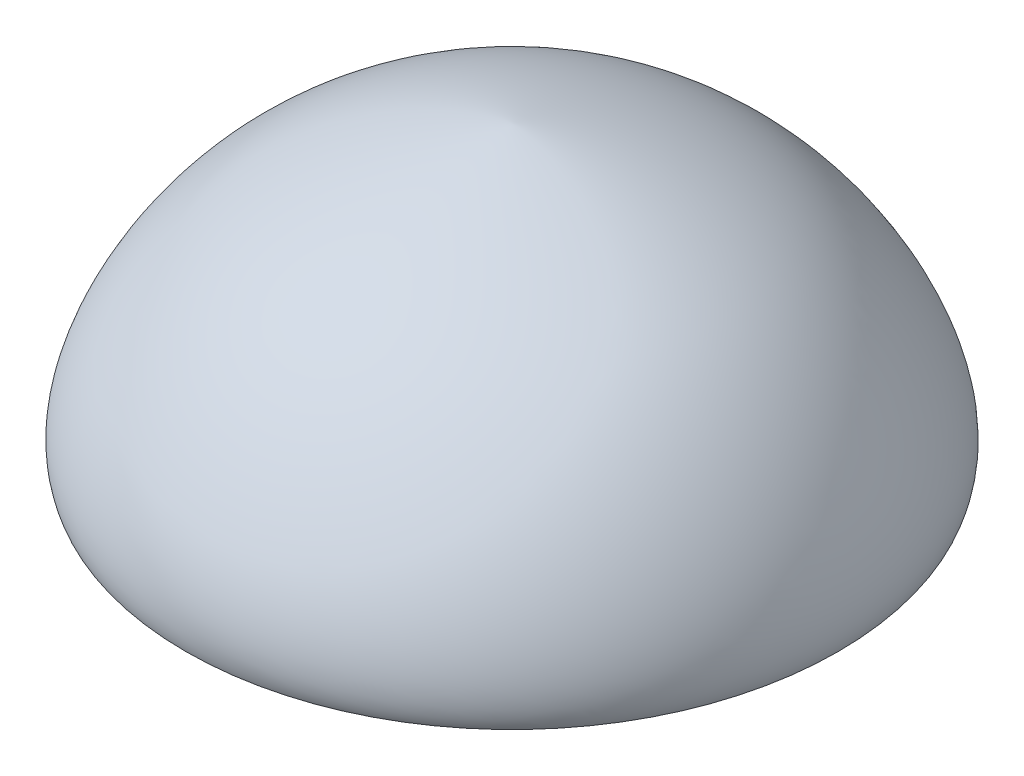
ISO-10303-21;
HEADER;
FILE_DESCRIPTION(('STEP AP214'),'2;1');
FILE_NAME('part.step','',(''),(''),'','','');
FILE_SCHEMA(('AUTOMOTIVE_DESIGN { 1 0 10303 214 1 1 1 1 }'));
ENDSEC;
DATA;
#1=APPLICATION_CONTEXT('core data for automotive mechanical design processes');
#2=APPLICATION_PROTOCOL_DEFINITION('international standard','automotive_design',2000,#1);
#3=PRODUCT_CONTEXT('',#1,'mechanical');
#4=PRODUCT('Part','Part','',(#3));
#5=PRODUCT_RELATED_PRODUCT_CATEGORY('part','',(#4));
#6=PRODUCT_DEFINITION_FORMATION('','',#4);
#7=PRODUCT_DEFINITION_CONTEXT('part definition',#1,'design');
#8=PRODUCT_DEFINITION('design','',#6,#7);
#9=PRODUCT_DEFINITION_SHAPE('','',#8);
#10=(LENGTH_UNIT() NAMED_UNIT(*) SI_UNIT(.MILLI.,.METRE.));
#11=(NAMED_UNIT(*) PLANE_ANGLE_UNIT() SI_UNIT($,.RADIAN.));
#12=(NAMED_UNIT(*) SI_UNIT($,.STERADIAN.) SOLID_ANGLE_UNIT());
#13=UNCERTAINTY_MEASURE_WITH_UNIT(LENGTH_MEASURE(1.E-05),#10,'distance_accuracy_value','');
#14=(GEOMETRIC_REPRESENTATION_CONTEXT(3) GLOBAL_UNCERTAINTY_ASSIGNED_CONTEXT((#13)) GLOBAL_UNIT_ASSIGNED_CONTEXT((#10,
#11,#12)) REPRESENTATION_CONTEXT('',''));
#15=CARTESIAN_POINT('',(0.,0.,0.));
#16=DIRECTION('',(0.,0.,1.));
#17=DIRECTION('',(1.,0.,0.));
#18=AXIS2_PLACEMENT_3D('',#15,#16,#17);
#19=CARTESIAN_POINT('',(0.5,0.,0.));
#20=CARTESIAN_POINT('',(0.525443724020926,0.0623045036922682,0.));
#21=CARTESIAN_POINT('',(0.389704349266153,0.378890471474151,0.));
#22=CARTESIAN_POINT('',(0.0254904385884982,0.45,0.));
#23=CARTESIAN_POINT('',(0.,0.45,0.));
#24=B_SPLINE_CURVE_WITH_KNOTS('',3,(#19,#20,#21,#22,#23),.UNSPECIFIED.,.F.,.F.,(4,1,4),(0.,
0.503823142963827,1.),.UNSPECIFIED.);
#25=CARTESIAN_POINT('',(0.,0.45,0.));
#26=DIRECTION('',(0.,1.,0.));
#27=AXIS1_PLACEMENT('',#25,#26);
#28=SURFACE_OF_REVOLUTION('',#24,#27);
#29=CARTESIAN_POINT('',(0.,0.45,0.));
#30=VERTEX_POINT('',#29);
#31=VERTEX_LOOP('',#30);
#32=FACE_BOUND('',#31,.T.);
#33=CARTESIAN_POINT('',(0.,0.,0.));
#34=DIRECTION('',(0.,1.,0.));
#35=DIRECTION('',(-1.,0.,0.));
#36=AXIS2_PLACEMENT_3D('',#33,#34,#35);
#37=CIRCLE('',#36,0.5);
#38=CARTESIAN_POINT('',(-0.5,0.,0.));
#39=VERTEX_POINT('',#38);
#40=EDGE_CURVE('E11',#39,#39,#37,.T.);
#41=ORIENTED_EDGE('',*,*,#40,.T.);
#42=EDGE_LOOP('',(#41));
#43=FACE_BOUND('',#42,.T.);
#44=ADVANCED_FACE('F35',(#32,#43),#28,.T.);
#45=CARTESIAN_POINT('',(0.,0.,0.));
#46=DIRECTION('',(0.,1.,0.));
#47=DIRECTION('',(-1.,0.,0.));
#48=AXIS2_PLACEMENT_3D('',#45,#46,#47);
#49=PLANE('',#48);
#50=ORIENTED_EDGE('',*,*,#40,.F.);
#51=EDGE_LOOP('',(#50));
#52=FACE_BOUND('',#51,.T.);
#53=ADVANCED_FACE('F46',(#52),#49,.F.);
#54=CLOSED_SHELL('',(#44,#53));
#55=MANIFOLD_SOLID_BREP('B2',#54);
#56=ADVANCED_BREP_SHAPE_REPRESENTATION('',(#18,#55),#14);
#57=SHAPE_DEFINITION_REPRESENTATION(#9,#56);
ENDSEC;
END-ISO-10303-21;
